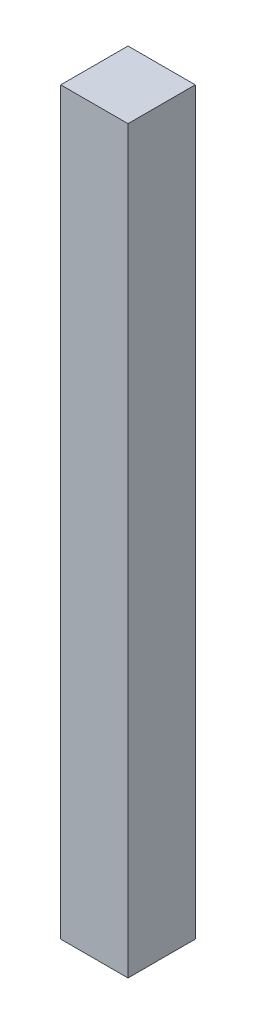
ISO-10303-21;
HEADER;
FILE_DESCRIPTION(('STEP AP214'),'2;1');
FILE_NAME('part.step','',(''),(''),'','','');
FILE_SCHEMA(('AUTOMOTIVE_DESIGN { 1 0 10303 214 1 1 1 1 }'));
ENDSEC;
DATA;
#1=APPLICATION_CONTEXT('core data for automotive mechanical design processes');
#2=APPLICATION_PROTOCOL_DEFINITION('international standard','automotive_design',2000,#1);
#3=PRODUCT_CONTEXT('',#1,'mechanical');
#4=PRODUCT('Part','Part','',(#3));
#5=PRODUCT_RELATED_PRODUCT_CATEGORY('part','',(#4));
#6=PRODUCT_DEFINITION_FORMATION('','',#4);
#7=PRODUCT_DEFINITION_CONTEXT('part definition',#1,'design');
#8=PRODUCT_DEFINITION('design','',#6,#7);
#9=PRODUCT_DEFINITION_SHAPE('','',#8);
#10=(LENGTH_UNIT() NAMED_UNIT(*) SI_UNIT(.MILLI.,.METRE.));
#11=(NAMED_UNIT(*) PLANE_ANGLE_UNIT() SI_UNIT($,.RADIAN.));
#12=(NAMED_UNIT(*) SI_UNIT($,.STERADIAN.) SOLID_ANGLE_UNIT());
#13=UNCERTAINTY_MEASURE_WITH_UNIT(LENGTH_MEASURE(1.E-05),#10,'distance_accuracy_value','');
#14=(GEOMETRIC_REPRESENTATION_CONTEXT(3) GLOBAL_UNCERTAINTY_ASSIGNED_CONTEXT((#13)) GLOBAL_UNIT_ASSIGNED_CONTEXT((#10,
#11,#12)) REPRESENTATION_CONTEXT('',''));
#15=CARTESIAN_POINT('',(0.,0.,0.));
#16=DIRECTION('',(0.,0.,1.));
#17=DIRECTION('',(1.,0.,0.));
#18=AXIS2_PLACEMENT_3D('',#15,#16,#17);
#19=CARTESIAN_POINT('',(0.,279.4,0.));
#20=DIRECTION('',(1.,0.,0.));
#21=DIRECTION('',(0.,0.,-1.));
#22=AXIS2_PLACEMENT_3D('',#19,#20,#21);
#23=PLANE('',#22);
#24=DIRECTION('',(0.,0.,1.));
#25=VECTOR('',#24,1.);
#26=CARTESIAN_POINT('',(0.,0.,0.));
#27=LINE('',#26,#25);
#28=CARTESIAN_POINT('',(0.,0.,-25.4));
#29=VERTEX_POINT('',#28);
#30=CARTESIAN_POINT('',(0.,0.,0.));
#31=VERTEX_POINT('',#30);
#32=EDGE_CURVE('E96',#29,#31,#27,.T.);
#33=ORIENTED_EDGE('',*,*,#32,.T.);
#34=DIRECTION('',(0.,-1.,0.));
#35=VECTOR('',#34,1.);
#36=CARTESIAN_POINT('',(0.,279.4,0.));
#37=LINE('',#36,#35);
#38=CARTESIAN_POINT('',(0.,279.4,0.));
#39=VERTEX_POINT('',#38);
#40=EDGE_CURVE('E11',#39,#31,#37,.T.);
#41=ORIENTED_EDGE('',*,*,#40,.F.);
#42=DIRECTION('',(0.,0.,1.));
#43=VECTOR('',#42,1.);
#44=CARTESIAN_POINT('',(0.,279.4,0.));
#45=LINE('',#44,#43);
#46=CARTESIAN_POINT('',(0.,279.4,-25.4));
#47=VERTEX_POINT('',#46);
#48=EDGE_CURVE('E84',#47,#39,#45,.T.);
#49=ORIENTED_EDGE('',*,*,#48,.F.);
#50=DIRECTION('',(0.,-1.,0.));
#51=VECTOR('',#50,1.);
#52=CARTESIAN_POINT('',(0.,279.4,-25.4));
#53=LINE('',#52,#51);
#54=EDGE_CURVE('E92',#47,#29,#53,.T.);
#55=ORIENTED_EDGE('',*,*,#54,.T.);
#56=EDGE_LOOP('',(#33,#41,#49,#55));
#57=FACE_BOUND('',#56,.T.);
#58=ADVANCED_FACE('F33',(#57),#23,.F.);
#59=CARTESIAN_POINT('',(0.,279.4,0.));
#60=DIRECTION('',(0.,0.,-1.));
#61=DIRECTION('',(-1.,0.,0.));
#62=AXIS2_PLACEMENT_3D('',#59,#60,#61);
#63=PLANE('',#62);
#64=DIRECTION('',(1.,0.,0.));
#65=VECTOR('',#64,1.);
#66=CARTESIAN_POINT('',(0.,0.,0.));
#67=LINE('',#66,#65);
#68=CARTESIAN_POINT('',(25.4,0.,0.));
#69=VERTEX_POINT('',#68);
#70=EDGE_CURVE('E88',#31,#69,#67,.T.);
#71=ORIENTED_EDGE('',*,*,#70,.T.);
#72=DIRECTION('',(0.,-1.,0.));
#73=VECTOR('',#72,1.);
#74=CARTESIAN_POINT('',(25.4,279.4,0.));
#75=LINE('',#74,#73);
#76=CARTESIAN_POINT('',(25.4,279.4,0.));
#77=VERTEX_POINT('',#76);
#78=EDGE_CURVE('E41',#77,#69,#75,.T.);
#79=ORIENTED_EDGE('',*,*,#78,.F.);
#80=DIRECTION('',(1.,0.,0.));
#81=VECTOR('',#80,1.);
#82=CARTESIAN_POINT('',(0.,279.4,0.));
#83=LINE('',#82,#81);
#84=EDGE_CURVE('E79',#39,#77,#83,.T.);
#85=ORIENTED_EDGE('',*,*,#84,.F.);
#86=ORIENTED_EDGE('',*,*,#40,.T.);
#87=EDGE_LOOP('',(#71,#79,#85,#86));
#88=FACE_BOUND('',#87,.T.);
#89=ADVANCED_FACE('F87',(#88),#63,.F.);
#90=CARTESIAN_POINT('',(25.4,279.4,0.));
#91=DIRECTION('',(-1.,0.,0.));
#92=DIRECTION('',(0.,0.,1.));
#93=AXIS2_PLACEMENT_3D('',#90,#91,#92);
#94=PLANE('',#93);
#95=DIRECTION('',(0.,0.,-1.));
#96=VECTOR('',#95,1.);
#97=CARTESIAN_POINT('',(25.4,0.,0.));
#98=LINE('',#97,#96);
#99=CARTESIAN_POINT('',(25.4,0.,-25.4));
#100=VERTEX_POINT('',#99);
#101=EDGE_CURVE('E66',#69,#100,#98,.T.);
#102=ORIENTED_EDGE('',*,*,#101,.T.);
#103=DIRECTION('',(0.,-1.,0.));
#104=VECTOR('',#103,1.);
#105=CARTESIAN_POINT('',(25.4,279.4,-25.4));
#106=LINE('',#105,#104);
#107=CARTESIAN_POINT('',(25.4,279.4,-25.4));
#108=VERTEX_POINT('',#107);
#109=EDGE_CURVE('E89',#108,#100,#106,.T.);
#110=ORIENTED_EDGE('',*,*,#109,.F.);
#111=DIRECTION('',(0.,0.,-1.));
#112=VECTOR('',#111,1.);
#113=CARTESIAN_POINT('',(25.4,279.4,0.));
#114=LINE('',#113,#112);
#115=EDGE_CURVE('E82',#77,#108,#114,.T.);
#116=ORIENTED_EDGE('',*,*,#115,.F.);
#117=ORIENTED_EDGE('',*,*,#78,.T.);
#118=EDGE_LOOP('',(#102,#110,#116,#117));
#119=FACE_BOUND('',#118,.T.);
#120=ADVANCED_FACE('F90',(#119),#94,.F.);
#121=CARTESIAN_POINT('',(0.,279.4,-25.4));
#122=DIRECTION('',(0.,0.,1.));
#123=DIRECTION('',(1.,0.,0.));
#124=AXIS2_PLACEMENT_3D('',#121,#122,#123);
#125=PLANE('',#124);
#126=DIRECTION('',(-1.,0.,0.));
#127=VECTOR('',#126,1.);
#128=CARTESIAN_POINT('',(0.,0.,-25.4));
#129=LINE('',#128,#127);
#130=EDGE_CURVE('E72',#100,#29,#129,.T.);
#131=ORIENTED_EDGE('',*,*,#130,.T.);
#132=ORIENTED_EDGE('',*,*,#54,.F.);
#133=DIRECTION('',(-1.,0.,0.));
#134=VECTOR('',#133,1.);
#135=CARTESIAN_POINT('',(0.,279.4,-25.4));
#136=LINE('',#135,#134);
#137=EDGE_CURVE('E49',#108,#47,#136,.T.);
#138=ORIENTED_EDGE('',*,*,#137,.F.);
#139=ORIENTED_EDGE('',*,*,#109,.T.);
#140=EDGE_LOOP('',(#131,#132,#138,#139));
#141=FACE_BOUND('',#140,.T.);
#142=ADVANCED_FACE('F103',(#141),#125,.F.);
#143=CARTESIAN_POINT('',(0.,279.4,0.));
#144=DIRECTION('',(0.,-1.,0.));
#145=DIRECTION('',(0.,0.,-1.));
#146=AXIS2_PLACEMENT_3D('',#143,#144,#145);
#147=PLANE('',#146);
#148=ORIENTED_EDGE('',*,*,#48,.T.);
#149=ORIENTED_EDGE('',*,*,#84,.T.);
#150=ORIENTED_EDGE('',*,*,#115,.T.);
#151=ORIENTED_EDGE('',*,*,#137,.T.);
#152=EDGE_LOOP('',(#148,#149,#150,#151));
#153=FACE_BOUND('',#152,.T.);
#154=ADVANCED_FACE('F80',(#153),#147,.F.);
#155=CARTESIAN_POINT('',(0.,0.,0.));
#156=DIRECTION('',(0.,-1.,0.));
#157=DIRECTION('',(0.,0.,-1.));
#158=AXIS2_PLACEMENT_3D('',#155,#156,#157);
#159=PLANE('',#158);
#160=ORIENTED_EDGE('',*,*,#32,.F.);
#161=ORIENTED_EDGE('',*,*,#130,.F.);
#162=ORIENTED_EDGE('',*,*,#101,.F.);
#163=ORIENTED_EDGE('',*,*,#70,.F.);
#164=EDGE_LOOP('',(#160,#161,#162,#163));
#165=FACE_BOUND('',#164,.T.);
#166=ADVANCED_FACE('F106',(#165),#159,.T.);
#167=CLOSED_SHELL('',(#58,#89,#120,#142,#154,#166));
#168=MANIFOLD_SOLID_BREP('B2',#167);
#169=ADVANCED_BREP_SHAPE_REPRESENTATION('',(#18,#168),#14);
#170=SHAPE_DEFINITION_REPRESENTATION(#9,#169);
ENDSEC;
END-ISO-10303-21;
